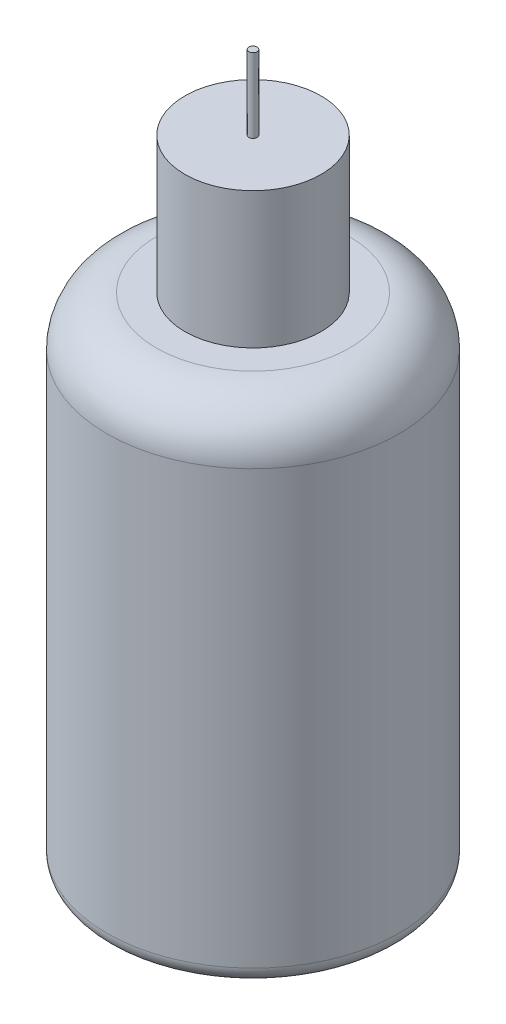
ISO-10303-21;
HEADER;
FILE_DESCRIPTION(('STEP AP214'),'2;1');
FILE_NAME('part.step','',(''),(''),'','','');
FILE_SCHEMA(('AUTOMOTIVE_DESIGN { 1 0 10303 214 1 1 1 1 }'));
ENDSEC;
DATA;
#1=APPLICATION_CONTEXT('core data for automotive mechanical design processes');
#2=APPLICATION_PROTOCOL_DEFINITION('international standard','automotive_design',2000,#1);
#3=PRODUCT_CONTEXT('',#1,'mechanical');
#4=PRODUCT('Part','Part','',(#3));
#5=PRODUCT_RELATED_PRODUCT_CATEGORY('part','',(#4));
#6=PRODUCT_DEFINITION_FORMATION('','',#4);
#7=PRODUCT_DEFINITION_CONTEXT('part definition',#1,'design');
#8=PRODUCT_DEFINITION('design','',#6,#7);
#9=PRODUCT_DEFINITION_SHAPE('','',#8);
#10=(LENGTH_UNIT() NAMED_UNIT(*) SI_UNIT(.MILLI.,.METRE.));
#11=(NAMED_UNIT(*) PLANE_ANGLE_UNIT() SI_UNIT($,.RADIAN.));
#12=(NAMED_UNIT(*) SI_UNIT($,.STERADIAN.) SOLID_ANGLE_UNIT());
#13=UNCERTAINTY_MEASURE_WITH_UNIT(LENGTH_MEASURE(1.E-05),#10,'distance_accuracy_value','');
#14=(GEOMETRIC_REPRESENTATION_CONTEXT(3) GLOBAL_UNCERTAINTY_ASSIGNED_CONTEXT((#13)) GLOBAL_UNIT_ASSIGNED_CONTEXT((#10,
#11,#12)) REPRESENTATION_CONTEXT('',''));
#15=CARTESIAN_POINT('',(0.,0.,0.));
#16=DIRECTION('',(0.,0.,1.));
#17=DIRECTION('',(1.,0.,0.));
#18=AXIS2_PLACEMENT_3D('',#15,#16,#17);
#19=CARTESIAN_POINT('',(0.,76.9,0.));
#20=DIRECTION('',(0.,1.,0.));
#21=DIRECTION('',(0.,0.,1.));
#22=AXIS2_PLACEMENT_3D('',#19,#20,#21);
#23=PLANE('',#22);
#24=CARTESIAN_POINT('',(0.,76.9,0.));
#25=DIRECTION('',(0.,1.,0.));
#26=DIRECTION('',(0.,0.,1.));
#27=AXIS2_PLACEMENT_3D('',#24,#25,#26);
#28=CIRCLE('',#27,8.25);
#29=CARTESIAN_POINT('',(0.,76.9,8.25));
#30=VERTEX_POINT('',#29);
#31=EDGE_CURVE('E50',#30,#30,#28,.T.);
#32=ORIENTED_EDGE('',*,*,#31,.T.);
#33=EDGE_LOOP('',(#32));
#34=FACE_BOUND('',#33,.T.);
#35=CARTESIAN_POINT('',(0.,76.9,0.));
#36=DIRECTION('',(0.,1.,0.));
#37=DIRECTION('',(0.,0.,1.));
#38=AXIS2_PLACEMENT_3D('',#35,#36,#37);
#39=CIRCLE('',#38,0.5);
#40=CARTESIAN_POINT('',(0.,76.9,0.5));
#41=VERTEX_POINT('',#40);
#42=EDGE_CURVE('E57',#41,#41,#39,.T.);
#43=ORIENTED_EDGE('',*,*,#42,.F.);
#44=EDGE_LOOP('',(#43));
#45=FACE_BOUND('',#44,.T.);
#46=ADVANCED_FACE('F30',(#34,#45),#23,.T.);
#47=CARTESIAN_POINT('',(0.,60.4,0.));
#48=DIRECTION('',(0.,1.,0.));
#49=DIRECTION('',(0.,0.,1.));
#50=AXIS2_PLACEMENT_3D('',#47,#48,#49);
#51=PLANE('',#50);
#52=CARTESIAN_POINT('',(0.,60.4,0.));
#53=DIRECTION('',(0.,1.,0.));
#54=DIRECTION('',(0.,0.,1.));
#55=AXIS2_PLACEMENT_3D('',#52,#53,#54);
#56=CIRCLE('',#55,11.7);
#57=CARTESIAN_POINT('',(0.,60.4,11.7));
#58=VERTEX_POINT('',#57);
#59=EDGE_CURVE('E45',#58,#58,#56,.T.);
#60=ORIENTED_EDGE('',*,*,#59,.T.);
#61=EDGE_LOOP('',(#60));
#62=FACE_BOUND('',#61,.T.);
#63=CARTESIAN_POINT('',(0.,60.4,0.));
#64=DIRECTION('',(0.,1.,0.));
#65=DIRECTION('',(0.,0.,1.));
#66=AXIS2_PLACEMENT_3D('',#63,#64,#65);
#67=CIRCLE('',#66,8.25);
#68=CARTESIAN_POINT('',(0.,60.4,8.25));
#69=VERTEX_POINT('',#68);
#70=EDGE_CURVE('E51',#69,#69,#67,.T.);
#71=ORIENTED_EDGE('',*,*,#70,.F.);
#72=EDGE_LOOP('',(#71));
#73=FACE_BOUND('',#72,.T.);
#74=ADVANCED_FACE('F73',(#62,#73),#51,.T.);
#75=CARTESIAN_POINT('',(0.,60.4,0.));
#76=DIRECTION('',(0.,-1.,0.));
#77=DIRECTION('',(0.,0.,-1.));
#78=AXIS2_PLACEMENT_3D('',#75,#76,#77);
#79=CYLINDRICAL_SURFACE('',#78,17.7);
#80=CARTESIAN_POINT('',(0.,2.,0.));
#81=DIRECTION('',(0.,1.,0.));
#82=DIRECTION('',(0.,0.,1.));
#83=AXIS2_PLACEMENT_3D('',#80,#81,#82);
#84=CIRCLE('',#83,17.7);
#85=CARTESIAN_POINT('',(0.,2.,17.7));
#86=VERTEX_POINT('',#85);
#87=EDGE_CURVE('E37',#86,#86,#84,.T.);
#88=ORIENTED_EDGE('',*,*,#87,.T.);
#89=EDGE_LOOP('',(#88));
#90=FACE_BOUND('',#89,.T.);
#91=CARTESIAN_POINT('',(0.,54.4,0.));
#92=DIRECTION('',(0.,1.,0.));
#93=DIRECTION('',(0.,0.,1.));
#94=AXIS2_PLACEMENT_3D('',#91,#92,#93);
#95=CIRCLE('',#94,17.7);
#96=CARTESIAN_POINT('',(0.,54.4,17.7));
#97=VERTEX_POINT('',#96);
#98=EDGE_CURVE('E41',#97,#97,#95,.F.);
#99=ORIENTED_EDGE('',*,*,#98,.T.);
#100=EDGE_LOOP('',(#99));
#101=FACE_BOUND('',#100,.T.);
#102=ADVANCED_FACE('F79',(#90,#101),#79,.T.);
#103=CARTESIAN_POINT('',(0.,0.,0.));
#104=DIRECTION('',(0.,1.,0.));
#105=DIRECTION('',(0.,0.,1.));
#106=AXIS2_PLACEMENT_3D('',#103,#104,#105);
#107=PLANE('',#106);
#108=CARTESIAN_POINT('',(0.,0.,0.));
#109=DIRECTION('',(0.,1.,0.));
#110=DIRECTION('',(0.,0.,1.));
#111=AXIS2_PLACEMENT_3D('',#108,#109,#110);
#112=CIRCLE('',#111,15.7);
#113=CARTESIAN_POINT('',(0.,0.,15.7));
#114=VERTEX_POINT('',#113);
#115=EDGE_CURVE('E10',#114,#114,#112,.F.);
#116=ORIENTED_EDGE('',*,*,#115,.T.);
#117=EDGE_LOOP('',(#116));
#118=FACE_BOUND('',#117,.T.);
#119=ADVANCED_FACE('F87',(#118),#107,.F.);
#120=CARTESIAN_POINT('',(0.,54.4,0.));
#121=DIRECTION('',(0.,1.,0.));
#122=DIRECTION('',(0.,0.,1.));
#123=AXIS2_PLACEMENT_3D('',#120,#121,#122);
#124=TOROIDAL_SURFACE('',#123,11.7,6.);
#125=ORIENTED_EDGE('',*,*,#98,.F.);
#126=EDGE_LOOP('',(#125));
#127=FACE_BOUND('',#126,.T.);
#128=ORIENTED_EDGE('',*,*,#59,.F.);
#129=EDGE_LOOP('',(#128));
#130=FACE_BOUND('',#129,.T.);
#131=ADVANCED_FACE('F90',(#127,#130),#124,.T.);
#132=CARTESIAN_POINT('',(0.,2.,0.));
#133=DIRECTION('',(0.,1.,0.));
#134=DIRECTION('',(0.,0.,1.));
#135=AXIS2_PLACEMENT_3D('',#132,#133,#134);
#136=TOROIDAL_SURFACE('',#135,15.7,2.);
#137=ORIENTED_EDGE('',*,*,#115,.F.);
#138=EDGE_LOOP('',(#137));
#139=FACE_BOUND('',#138,.T.);
#140=ORIENTED_EDGE('',*,*,#87,.F.);
#141=EDGE_LOOP('',(#140));
#142=FACE_BOUND('',#141,.T.);
#143=ADVANCED_FACE('F32',(#139,#142),#136,.T.);
#144=CARTESIAN_POINT('',(0.,76.9,0.));
#145=DIRECTION('',(0.,-1.,0.));
#146=DIRECTION('',(0.,0.,-1.));
#147=AXIS2_PLACEMENT_3D('',#144,#145,#146);
#148=CYLINDRICAL_SURFACE('',#147,8.25);
#149=ORIENTED_EDGE('',*,*,#31,.F.);
#150=EDGE_LOOP('',(#149));
#151=FACE_BOUND('',#150,.T.);
#152=ORIENTED_EDGE('',*,*,#70,.T.);
#153=EDGE_LOOP('',(#152));
#154=FACE_BOUND('',#153,.T.);
#155=ADVANCED_FACE('F68',(#151,#154),#148,.T.);
#156=CARTESIAN_POINT('',(0.,85.9,0.));
#157=DIRECTION('',(0.,-1.,0.));
#158=DIRECTION('',(0.,0.,-1.));
#159=AXIS2_PLACEMENT_3D('',#156,#157,#158);
#160=CYLINDRICAL_SURFACE('',#159,0.5);
#161=CARTESIAN_POINT('',(0.,85.9,0.));
#162=DIRECTION('',(0.,1.,0.));
#163=DIRECTION('',(0.,0.,1.));
#164=AXIS2_PLACEMENT_3D('',#161,#162,#163);
#165=CIRCLE('',#164,0.5);
#166=CARTESIAN_POINT('',(0.,85.9,0.5));
#167=VERTEX_POINT('',#166);
#168=EDGE_CURVE('E54',#167,#167,#165,.T.);
#169=ORIENTED_EDGE('',*,*,#168,.F.);
#170=EDGE_LOOP('',(#169));
#171=FACE_BOUND('',#170,.T.);
#172=ORIENTED_EDGE('',*,*,#42,.T.);
#173=EDGE_LOOP('',(#172));
#174=FACE_BOUND('',#173,.T.);
#175=ADVANCED_FACE('F65',(#171,#174),#160,.T.);
#176=CARTESIAN_POINT('',(0.,85.9,0.));
#177=DIRECTION('',(0.,1.,0.));
#178=DIRECTION('',(0.,0.,1.));
#179=AXIS2_PLACEMENT_3D('',#176,#177,#178);
#180=PLANE('',#179);
#181=ORIENTED_EDGE('',*,*,#168,.T.);
#182=EDGE_LOOP('',(#181));
#183=FACE_BOUND('',#182,.T.);
#184=ADVANCED_FACE('F63',(#183),#180,.T.);
#185=CLOSED_SHELL('',(#46,#74,#102,#119,#131,#143,#155,#175,#184));
#186=MANIFOLD_SOLID_BREP('B2',#185);
#187=ADVANCED_BREP_SHAPE_REPRESENTATION('',(#18,#186),#14);
#188=SHAPE_DEFINITION_REPRESENTATION(#9,#187);
ENDSEC;
END-ISO-10303-21;
